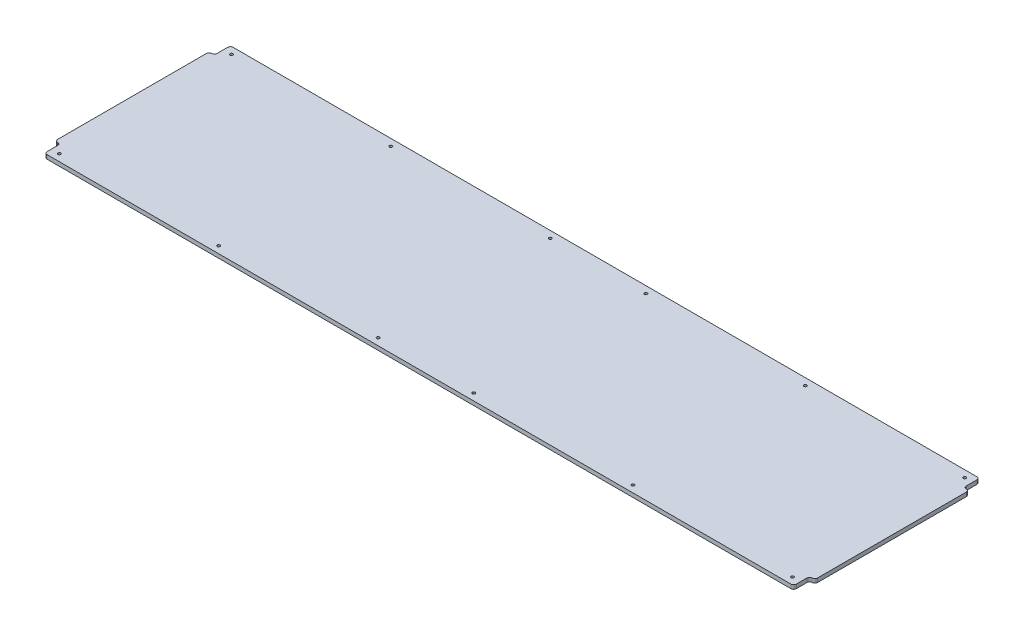
ISO-10303-21;
HEADER;
FILE_DESCRIPTION(('STEP AP214'),'2;1');
FILE_NAME('part.step','',(''),(''),'','','');
FILE_SCHEMA(('AUTOMOTIVE_DESIGN { 1 0 10303 214 1 1 1 1 }'));
ENDSEC;
DATA;
#1=APPLICATION_CONTEXT('core data for automotive mechanical design processes');
#2=APPLICATION_PROTOCOL_DEFINITION('international standard','automotive_design',2000,#1);
#3=PRODUCT_CONTEXT('',#1,'mechanical');
#4=PRODUCT('Part','Part','',(#3));
#5=PRODUCT_RELATED_PRODUCT_CATEGORY('part','',(#4));
#6=PRODUCT_DEFINITION_FORMATION('','',#4);
#7=PRODUCT_DEFINITION_CONTEXT('part definition',#1,'design');
#8=PRODUCT_DEFINITION('design','',#6,#7);
#9=PRODUCT_DEFINITION_SHAPE('','',#8);
#10=(LENGTH_UNIT() NAMED_UNIT(*) SI_UNIT(.MILLI.,.METRE.));
#11=(NAMED_UNIT(*) PLANE_ANGLE_UNIT() SI_UNIT($,.RADIAN.));
#12=(NAMED_UNIT(*) SI_UNIT($,.STERADIAN.) SOLID_ANGLE_UNIT());
#13=UNCERTAINTY_MEASURE_WITH_UNIT(LENGTH_MEASURE(1.E-05),#10,'distance_accuracy_value','');
#14=(GEOMETRIC_REPRESENTATION_CONTEXT(3) GLOBAL_UNCERTAINTY_ASSIGNED_CONTEXT((#13)) GLOBAL_UNIT_ASSIGNED_CONTEXT((#10,
#11,#12)) REPRESENTATION_CONTEXT('',''));
#15=CARTESIAN_POINT('',(0.,0.,0.));
#16=DIRECTION('',(0.,0.,1.));
#17=DIRECTION('',(1.,0.,0.));
#18=AXIS2_PLACEMENT_3D('',#15,#16,#17);
#19=CARTESIAN_POINT('',(895.35,9.525,222.25));
#20=DIRECTION('',(-1.,0.,0.));
#21=DIRECTION('',(0.,0.,1.));
#22=AXIS2_PLACEMENT_3D('',#19,#20,#21);
#23=PLANE('',#22);
#24=DIRECTION('',(0.,0.,-1.));
#25=VECTOR('',#24,1.);
#26=CARTESIAN_POINT('',(895.35,9.525,222.25));
#27=LINE('',#26,#25);
#28=CARTESIAN_POINT('',(895.35,9.525,215.9));
#29=VERTEX_POINT('',#28);
#30=CARTESIAN_POINT('',(895.35,9.525,190.5));
#31=VERTEX_POINT('',#30);
#32=EDGE_CURVE('E201',#29,#31,#27,.T.);
#33=ORIENTED_EDGE('',*,*,#32,.F.);
#34=DIRECTION('',(0.,-1.,0.));
#35=VECTOR('',#34,1.);
#36=CARTESIAN_POINT('',(895.35,9.525,215.9));
#37=LINE('',#36,#35);
#38=CARTESIAN_POINT('',(895.35,0.,215.9));
#39=VERTEX_POINT('',#38);
#40=EDGE_CURVE('E184',#29,#39,#37,.T.);
#41=ORIENTED_EDGE('',*,*,#40,.T.);
#42=DIRECTION('',(0.,0.,-1.));
#43=VECTOR('',#42,1.);
#44=CARTESIAN_POINT('',(895.35,0.,222.25));
#45=LINE('',#44,#43);
#46=CARTESIAN_POINT('',(895.35,0.,190.5));
#47=VERTEX_POINT('',#46);
#48=EDGE_CURVE('E198',#39,#47,#45,.T.);
#49=ORIENTED_EDGE('',*,*,#48,.T.);
#50=DIRECTION('',(0.,-1.,0.));
#51=VECTOR('',#50,1.);
#52=CARTESIAN_POINT('',(895.35,9.525,190.5));
#53=LINE('',#52,#51);
#54=EDGE_CURVE('E204',#47,#31,#53,.F.);
#55=ORIENTED_EDGE('',*,*,#54,.T.);
#56=EDGE_LOOP('',(#33,#41,#49,#55));
#57=FACE_BOUND('',#56,.T.);
#58=ADVANCED_FACE('F41',(#57),#23,.F.);
#59=CARTESIAN_POINT('',(908.05,9.525,-184.15));
#60=DIRECTION('',(-1.,0.,0.));
#61=DIRECTION('',(0.,0.,1.));
#62=AXIS2_PLACEMENT_3D('',#59,#60,#61);
#63=PLANE('',#62);
#64=DIRECTION('',(0.,0.,-1.));
#65=VECTOR('',#64,1.);
#66=CARTESIAN_POINT('',(908.05,9.525,-184.15));
#67=LINE('',#66,#65);
#68=CARTESIAN_POINT('',(908.05,9.525,177.8));
#69=VERTEX_POINT('',#68);
#70=CARTESIAN_POINT('',(908.05,9.525,-177.8));
#71=VERTEX_POINT('',#70);
#72=EDGE_CURVE('E697',#69,#71,#67,.T.);
#73=ORIENTED_EDGE('',*,*,#72,.F.);
#74=DIRECTION('',(0.,-1.,0.));
#75=VECTOR('',#74,1.);
#76=CARTESIAN_POINT('',(908.05,9.525,177.8));
#77=LINE('',#76,#75);
#78=CARTESIAN_POINT('',(908.05,0.,177.8));
#79=VERTEX_POINT('',#78);
#80=EDGE_CURVE('E301',#69,#79,#77,.T.);
#81=ORIENTED_EDGE('',*,*,#80,.T.);
#82=DIRECTION('',(0.,0.,-1.));
#83=VECTOR('',#82,1.);
#84=CARTESIAN_POINT('',(908.05,0.,-184.15));
#85=LINE('',#84,#83);
#86=CARTESIAN_POINT('',(908.05,0.,-177.8));
#87=VERTEX_POINT('',#86);
#88=EDGE_CURVE('E210',#79,#87,#85,.T.);
#89=ORIENTED_EDGE('',*,*,#88,.T.);
#90=DIRECTION('',(0.,-1.,0.));
#91=VECTOR('',#90,1.);
#92=CARTESIAN_POINT('',(908.05,9.525,-177.8));
#93=LINE('',#92,#91);
#94=EDGE_CURVE('E297',#87,#71,#93,.F.);
#95=ORIENTED_EDGE('',*,*,#94,.T.);
#96=EDGE_LOOP('',(#73,#81,#89,#95));
#97=FACE_BOUND('',#96,.T.);
#98=ADVANCED_FACE('F439',(#97),#63,.F.);
#99=CARTESIAN_POINT('',(895.35,9.525,-222.25));
#100=DIRECTION('',(-1.,0.,0.));
#101=DIRECTION('',(0.,0.,1.));
#102=AXIS2_PLACEMENT_3D('',#99,#100,#101);
#103=PLANE('',#102);
#104=DIRECTION('',(0.,0.,-1.));
#105=VECTOR('',#104,1.);
#106=CARTESIAN_POINT('',(895.35,9.525,-222.25));
#107=LINE('',#106,#105);
#108=CARTESIAN_POINT('',(895.35,9.525,-190.5));
#109=VERTEX_POINT('',#108);
#110=CARTESIAN_POINT('',(895.35,9.525,-215.9));
#111=VERTEX_POINT('',#110);
#112=EDGE_CURVE('E415',#109,#111,#107,.T.);
#113=ORIENTED_EDGE('',*,*,#112,.F.);
#114=DIRECTION('',(0.,-1.,0.));
#115=VECTOR('',#114,1.);
#116=CARTESIAN_POINT('',(895.35,0.,-190.5));
#117=LINE('',#116,#115);
#118=CARTESIAN_POINT('',(895.35,0.,-190.5));
#119=VERTEX_POINT('',#118);
#120=EDGE_CURVE('E307',#109,#119,#117,.T.);
#121=ORIENTED_EDGE('',*,*,#120,.T.);
#122=DIRECTION('',(0.,0.,-1.));
#123=VECTOR('',#122,1.);
#124=CARTESIAN_POINT('',(895.35,0.,-222.25));
#125=LINE('',#124,#123);
#126=CARTESIAN_POINT('',(895.35,0.,-215.9));
#127=VERTEX_POINT('',#126);
#128=EDGE_CURVE('E217',#119,#127,#125,.T.);
#129=ORIENTED_EDGE('',*,*,#128,.T.);
#130=DIRECTION('',(0.,-1.,0.));
#131=VECTOR('',#130,1.);
#132=CARTESIAN_POINT('',(895.35,9.525,-215.9));
#133=LINE('',#132,#131);
#134=EDGE_CURVE('E304',#127,#111,#133,.F.);
#135=ORIENTED_EDGE('',*,*,#134,.T.);
#136=EDGE_LOOP('',(#113,#121,#129,#135));
#137=FACE_BOUND('',#136,.T.);
#138=ADVANCED_FACE('F444',(#137),#103,.F.);
#139=CARTESIAN_POINT('',(-895.35,9.525,-222.25));
#140=DIRECTION('',(0.,0.,1.));
#141=DIRECTION('',(1.,0.,0.));
#142=AXIS2_PLACEMENT_3D('',#139,#140,#141);
#143=PLANE('',#142);
#144=DIRECTION('',(-1.,0.,0.));
#145=VECTOR('',#144,1.);
#146=CARTESIAN_POINT('',(-895.35,9.525,-222.25));
#147=LINE('',#146,#145);
#148=CARTESIAN_POINT('',(889.,9.525,-222.25));
#149=VERTEX_POINT('',#148);
#150=CARTESIAN_POINT('',(-889.,9.525,-222.25));
#151=VERTEX_POINT('',#150);
#152=EDGE_CURVE('E408',#149,#151,#147,.T.);
#153=ORIENTED_EDGE('',*,*,#152,.F.);
#154=DIRECTION('',(0.,-1.,0.));
#155=VECTOR('',#154,1.);
#156=CARTESIAN_POINT('',(889.,9.525,-222.25));
#157=LINE('',#156,#155);
#158=CARTESIAN_POINT('',(889.,0.,-222.25));
#159=VERTEX_POINT('',#158);
#160=EDGE_CURVE('E313',#149,#159,#157,.T.);
#161=ORIENTED_EDGE('',*,*,#160,.T.);
#162=DIRECTION('',(-1.,0.,0.));
#163=VECTOR('',#162,1.);
#164=CARTESIAN_POINT('',(-895.35,0.,-222.25));
#165=LINE('',#164,#163);
#166=CARTESIAN_POINT('',(-889.,0.,-222.25));
#167=VERTEX_POINT('',#166);
#168=EDGE_CURVE('E229',#159,#167,#165,.T.);
#169=ORIENTED_EDGE('',*,*,#168,.T.);
#170=DIRECTION('',(0.,-1.,0.));
#171=VECTOR('',#170,1.);
#172=CARTESIAN_POINT('',(-889.,9.525,-222.25));
#173=LINE('',#172,#171);
#174=EDGE_CURVE('E310',#167,#151,#173,.F.);
#175=ORIENTED_EDGE('',*,*,#174,.T.);
#176=EDGE_LOOP('',(#153,#161,#169,#175));
#177=FACE_BOUND('',#176,.T.);
#178=ADVANCED_FACE('F659',(#177),#143,.F.);
#179=CARTESIAN_POINT('',(-895.35,9.525,-222.25));
#180=DIRECTION('',(1.,0.,0.));
#181=DIRECTION('',(0.,0.,-1.));
#182=AXIS2_PLACEMENT_3D('',#179,#180,#181);
#183=PLANE('',#182);
#184=DIRECTION('',(0.,0.,1.));
#185=VECTOR('',#184,1.);
#186=CARTESIAN_POINT('',(-895.35,0.,-222.25));
#187=LINE('',#186,#185);
#188=CARTESIAN_POINT('',(-895.35,0.,-215.9));
#189=VERTEX_POINT('',#188);
#190=CARTESIAN_POINT('',(-895.35,0.,-190.5));
#191=VERTEX_POINT('',#190);
#192=EDGE_CURVE('E233',#189,#191,#187,.T.);
#193=ORIENTED_EDGE('',*,*,#192,.T.);
#194=DIRECTION('',(0.,-1.,0.));
#195=VECTOR('',#194,1.);
#196=CARTESIAN_POINT('',(-895.35,9.525,-190.5));
#197=LINE('',#196,#195);
#198=CARTESIAN_POINT('',(-895.35,9.525,-190.5));
#199=VERTEX_POINT('',#198);
#200=EDGE_CURVE('E328',#191,#199,#197,.F.);
#201=ORIENTED_EDGE('',*,*,#200,.T.);
#202=DIRECTION('',(0.,0.,1.));
#203=VECTOR('',#202,1.);
#204=CARTESIAN_POINT('',(-895.35,9.525,-222.25));
#205=LINE('',#204,#203);
#206=CARTESIAN_POINT('',(-895.35,9.525,-215.9));
#207=VERTEX_POINT('',#206);
#208=EDGE_CURVE('E401',#207,#199,#205,.T.);
#209=ORIENTED_EDGE('',*,*,#208,.F.);
#210=DIRECTION('',(0.,-1.,0.));
#211=VECTOR('',#210,1.);
#212=CARTESIAN_POINT('',(-895.35,9.525,-215.9));
#213=LINE('',#212,#211);
#214=EDGE_CURVE('E324',#207,#189,#213,.T.);
#215=ORIENTED_EDGE('',*,*,#214,.T.);
#216=EDGE_LOOP('',(#193,#201,#209,#215));
#217=FACE_BOUND('',#216,.T.);
#218=ADVANCED_FACE('F400',(#217),#183,.F.);
#219=CARTESIAN_POINT('',(-908.05,9.525,-184.15));
#220=DIRECTION('',(1.,0.,0.));
#221=DIRECTION('',(0.,0.,-1.));
#222=AXIS2_PLACEMENT_3D('',#219,#220,#221);
#223=PLANE('',#222);
#224=DIRECTION('',(0.,0.,1.));
#225=VECTOR('',#224,1.);
#226=CARTESIAN_POINT('',(-908.05,9.525,-184.15));
#227=LINE('',#226,#225);
#228=CARTESIAN_POINT('',(-908.05,9.525,-177.8));
#229=VERTEX_POINT('',#228);
#230=CARTESIAN_POINT('',(-908.05,9.525,177.8));
#231=VERTEX_POINT('',#230);
#232=EDGE_CURVE('E389',#229,#231,#227,.T.);
#233=ORIENTED_EDGE('',*,*,#232,.F.);
#234=DIRECTION('',(0.,-1.,0.));
#235=VECTOR('',#234,1.);
#236=CARTESIAN_POINT('',(-908.05,9.525,-177.8));
#237=LINE('',#236,#235);
#238=CARTESIAN_POINT('',(-908.05,0.,-177.8));
#239=VERTEX_POINT('',#238);
#240=EDGE_CURVE('E320',#229,#239,#237,.T.);
#241=ORIENTED_EDGE('',*,*,#240,.T.);
#242=DIRECTION('',(0.,0.,1.));
#243=VECTOR('',#242,1.);
#244=CARTESIAN_POINT('',(-908.05,0.,-184.15));
#245=LINE('',#244,#243);
#246=CARTESIAN_POINT('',(-908.05,0.,177.8));
#247=VERTEX_POINT('',#246);
#248=EDGE_CURVE('E237',#239,#247,#245,.T.);
#249=ORIENTED_EDGE('',*,*,#248,.T.);
#250=DIRECTION('',(0.,-1.,0.));
#251=VECTOR('',#250,1.);
#252=CARTESIAN_POINT('',(-908.05,9.525,177.8));
#253=LINE('',#252,#251);
#254=EDGE_CURVE('E317',#247,#231,#253,.F.);
#255=ORIENTED_EDGE('',*,*,#254,.T.);
#256=EDGE_LOOP('',(#233,#241,#249,#255));
#257=FACE_BOUND('',#256,.T.);
#258=ADVANCED_FACE('F386',(#257),#223,.F.);
#259=CARTESIAN_POINT('',(-895.35,9.525,184.15));
#260=DIRECTION('',(1.,0.,0.));
#261=DIRECTION('',(0.,0.,-1.));
#262=AXIS2_PLACEMENT_3D('',#259,#260,#261);
#263=PLANE('',#262);
#264=DIRECTION('',(0.,0.,1.));
#265=VECTOR('',#264,1.);
#266=CARTESIAN_POINT('',(-895.35,0.,184.15));
#267=LINE('',#266,#265);
#268=CARTESIAN_POINT('',(-895.35,0.,190.5));
#269=VERTEX_POINT('',#268);
#270=CARTESIAN_POINT('',(-895.35,0.,215.9));
#271=VERTEX_POINT('',#270);
#272=EDGE_CURVE('E241',#269,#271,#267,.T.);
#273=ORIENTED_EDGE('',*,*,#272,.T.);
#274=DIRECTION('',(0.,-1.,0.));
#275=VECTOR('',#274,1.);
#276=CARTESIAN_POINT('',(-895.35,9.525,215.9));
#277=LINE('',#276,#275);
#278=CARTESIAN_POINT('',(-895.35,9.525,215.9));
#279=VERTEX_POINT('',#278);
#280=EDGE_CURVE('E59',#271,#279,#277,.F.);
#281=ORIENTED_EDGE('',*,*,#280,.T.);
#282=DIRECTION('',(0.,0.,1.));
#283=VECTOR('',#282,1.);
#284=CARTESIAN_POINT('',(-895.35,9.525,184.15));
#285=LINE('',#284,#283);
#286=CARTESIAN_POINT('',(-895.35,9.525,190.5));
#287=VERTEX_POINT('',#286);
#288=EDGE_CURVE('E413',#287,#279,#285,.T.);
#289=ORIENTED_EDGE('',*,*,#288,.F.);
#290=DIRECTION('',(0.,-1.,0.));
#291=VECTOR('',#290,1.);
#292=CARTESIAN_POINT('',(-895.35,0.,190.5));
#293=LINE('',#292,#291);
#294=EDGE_CURVE('E331',#287,#269,#293,.T.);
#295=ORIENTED_EDGE('',*,*,#294,.T.);
#296=EDGE_LOOP('',(#273,#281,#289,#295));
#297=FACE_BOUND('',#296,.T.);
#298=ADVANCED_FACE('F429',(#297),#263,.F.);
#299=CARTESIAN_POINT('',(-895.35,9.525,222.25));
#300=DIRECTION('',(0.,0.,-1.));
#301=DIRECTION('',(-1.,0.,0.));
#302=AXIS2_PLACEMENT_3D('',#299,#300,#301);
#303=PLANE('',#302);
#304=DIRECTION('',(1.,0.,0.));
#305=VECTOR('',#304,1.);
#306=CARTESIAN_POINT('',(-895.35,0.,222.25));
#307=LINE('',#306,#305);
#308=CARTESIAN_POINT('',(-889.,0.,222.25));
#309=VERTEX_POINT('',#308);
#310=CARTESIAN_POINT('',(889.,0.,222.25));
#311=VERTEX_POINT('',#310);
#312=EDGE_CURVE('E244',#309,#311,#307,.T.);
#313=ORIENTED_EDGE('',*,*,#312,.T.);
#314=DIRECTION('',(0.,-1.,0.));
#315=VECTOR('',#314,1.);
#316=CARTESIAN_POINT('',(889.,9.525,222.25));
#317=LINE('',#316,#315);
#318=CARTESIAN_POINT('',(889.,9.525,222.25));
#319=VERTEX_POINT('',#318);
#320=EDGE_CURVE('E185',#311,#319,#317,.F.);
#321=ORIENTED_EDGE('',*,*,#320,.T.);
#322=DIRECTION('',(1.,0.,0.));
#323=VECTOR('',#322,1.);
#324=CARTESIAN_POINT('',(-895.35,9.525,222.25));
#325=LINE('',#324,#323);
#326=CARTESIAN_POINT('',(-889.,9.525,222.25));
#327=VERTEX_POINT('',#326);
#328=EDGE_CURVE('E223',#327,#319,#325,.T.);
#329=ORIENTED_EDGE('',*,*,#328,.F.);
#330=DIRECTION('',(0.,-1.,0.));
#331=VECTOR('',#330,1.);
#332=CARTESIAN_POINT('',(-889.,9.525,222.25));
#333=LINE('',#332,#331);
#334=EDGE_CURVE('E191',#327,#309,#333,.T.);
#335=ORIENTED_EDGE('',*,*,#334,.T.);
#336=EDGE_LOOP('',(#313,#321,#329,#335));
#337=FACE_BOUND('',#336,.T.);
#338=ADVANCED_FACE('F426',(#337),#303,.F.);
#339=CARTESIAN_POINT('',(0.,9.525,0.));
#340=DIRECTION('',(0.,1.,0.));
#341=DIRECTION('',(0.,0.,1.));
#342=AXIS2_PLACEMENT_3D('',#339,#340,#341);
#343=PLANE('',#342);
#344=CARTESIAN_POINT('',(-876.3,9.525,205.74));
#345=DIRECTION('',(0.,1.,0.));
#346=DIRECTION('',(0.,0.,1.));
#347=AXIS2_PLACEMENT_3D('',#344,#345,#346);
#348=CIRCLE('',#347,3.373501);
#349=CARTESIAN_POINT('',(-876.3,9.525,209.113501));
#350=VERTEX_POINT('',#349);
#351=EDGE_CURVE('E360',#350,#350,#348,.T.);
#352=ORIENTED_EDGE('',*,*,#351,.F.);
#353=EDGE_LOOP('',(#352));
#354=FACE_BOUND('',#353,.T.);
#355=CARTESIAN_POINT('',(-495.3,9.525,205.74));
#356=DIRECTION('',(0.,1.,0.));
#357=DIRECTION('',(0.,0.,1.));
#358=AXIS2_PLACEMENT_3D('',#355,#356,#357);
#359=CIRCLE('',#358,3.373501);
#360=CARTESIAN_POINT('',(-495.3,9.525,209.113501));
#361=VERTEX_POINT('',#360);
#362=EDGE_CURVE('E798',#361,#361,#359,.T.);
#363=ORIENTED_EDGE('',*,*,#362,.F.);
#364=EDGE_LOOP('',(#363));
#365=FACE_BOUND('',#364,.T.);
#366=CARTESIAN_POINT('',(-876.3,9.525,-205.74));
#367=DIRECTION('',(0.,1.,0.));
#368=DIRECTION('',(0.,0.,1.));
#369=AXIS2_PLACEMENT_3D('',#366,#367,#368);
#370=CIRCLE('',#369,3.373501);
#371=CARTESIAN_POINT('',(-876.3,9.525,-202.366499));
#372=VERTEX_POINT('',#371);
#373=EDGE_CURVE('E790',#372,#372,#370,.T.);
#374=ORIENTED_EDGE('',*,*,#373,.F.);
#375=EDGE_LOOP('',(#374));
#376=FACE_BOUND('',#375,.T.);
#377=CARTESIAN_POINT('',(-495.3,9.525,-205.74));
#378=DIRECTION('',(0.,1.,0.));
#379=DIRECTION('',(0.,0.,1.));
#380=AXIS2_PLACEMENT_3D('',#377,#378,#379);
#381=CIRCLE('',#380,3.373501);
#382=CARTESIAN_POINT('',(-495.3,9.525,-202.366499));
#383=VERTEX_POINT('',#382);
#384=EDGE_CURVE('E782',#383,#383,#381,.T.);
#385=ORIENTED_EDGE('',*,*,#384,.F.);
#386=EDGE_LOOP('',(#385));
#387=FACE_BOUND('',#386,.T.);
#388=CARTESIAN_POINT('',(-114.3,9.525,-205.74));
#389=DIRECTION('',(0.,1.,0.));
#390=DIRECTION('',(0.,0.,1.));
#391=AXIS2_PLACEMENT_3D('',#388,#389,#390);
#392=CIRCLE('',#391,3.373501);
#393=CARTESIAN_POINT('',(-114.3,9.525,-202.366499));
#394=VERTEX_POINT('',#393);
#395=EDGE_CURVE('E774',#394,#394,#392,.T.);
#396=ORIENTED_EDGE('',*,*,#395,.F.);
#397=EDGE_LOOP('',(#396));
#398=FACE_BOUND('',#397,.T.);
#399=CARTESIAN_POINT('',(-114.3,9.525,205.74));
#400=DIRECTION('',(0.,1.,0.));
#401=DIRECTION('',(0.,0.,1.));
#402=AXIS2_PLACEMENT_3D('',#399,#400,#401);
#403=CIRCLE('',#402,3.373501);
#404=CARTESIAN_POINT('',(-114.3,9.525,209.113501));
#405=VERTEX_POINT('',#404);
#406=EDGE_CURVE('E766',#405,#405,#403,.T.);
#407=ORIENTED_EDGE('',*,*,#406,.F.);
#408=EDGE_LOOP('',(#407));
#409=FACE_BOUND('',#408,.T.);
#410=CARTESIAN_POINT('',(114.299999999999,9.525,205.74));
#411=DIRECTION('',(0.,1.,0.));
#412=DIRECTION('',(0.,0.,1.));
#413=AXIS2_PLACEMENT_3D('',#410,#411,#412);
#414=CIRCLE('',#413,3.373501);
#415=CARTESIAN_POINT('',(114.299999999999,9.525,209.113501));
#416=VERTEX_POINT('',#415);
#417=EDGE_CURVE('E758',#416,#416,#414,.T.);
#418=ORIENTED_EDGE('',*,*,#417,.F.);
#419=EDGE_LOOP('',(#418));
#420=FACE_BOUND('',#419,.T.);
#421=CARTESIAN_POINT('',(114.3,9.525,-205.74));
#422=DIRECTION('',(0.,1.,0.));
#423=DIRECTION('',(0.,0.,1.));
#424=AXIS2_PLACEMENT_3D('',#421,#422,#423);
#425=CIRCLE('',#424,3.373501);
#426=CARTESIAN_POINT('',(114.3,9.525,-202.366499));
#427=VERTEX_POINT('',#426);
#428=EDGE_CURVE('E750',#427,#427,#425,.T.);
#429=ORIENTED_EDGE('',*,*,#428,.F.);
#430=EDGE_LOOP('',(#429));
#431=FACE_BOUND('',#430,.T.);
#432=CARTESIAN_POINT('',(495.3,9.525,-205.739999999999));
#433=DIRECTION('',(0.,1.,0.));
#434=DIRECTION('',(0.,0.,1.));
#435=AXIS2_PLACEMENT_3D('',#432,#433,#434);
#436=CIRCLE('',#435,3.373501);
#437=CARTESIAN_POINT('',(495.3,9.525,-202.366498999999));
#438=VERTEX_POINT('',#437);
#439=EDGE_CURVE('E742',#438,#438,#436,.T.);
#440=ORIENTED_EDGE('',*,*,#439,.F.);
#441=EDGE_LOOP('',(#440));
#442=FACE_BOUND('',#441,.T.);
#443=CARTESIAN_POINT('',(876.3,9.525,-205.739999999999));
#444=DIRECTION('',(0.,1.,0.));
#445=DIRECTION('',(0.,0.,1.));
#446=AXIS2_PLACEMENT_3D('',#443,#444,#445);
#447=CIRCLE('',#446,3.373501);
#448=CARTESIAN_POINT('',(876.3,9.525,-202.366498999999));
#449=VERTEX_POINT('',#448);
#450=EDGE_CURVE('E734',#449,#449,#447,.T.);
#451=ORIENTED_EDGE('',*,*,#450,.F.);
#452=EDGE_LOOP('',(#451));
#453=FACE_BOUND('',#452,.T.);
#454=CARTESIAN_POINT('',(495.299999999999,9.525,205.74));
#455=DIRECTION('',(0.,1.,0.));
#456=DIRECTION('',(0.,0.,1.));
#457=AXIS2_PLACEMENT_3D('',#454,#455,#456);
#458=CIRCLE('',#457,3.373501);
#459=CARTESIAN_POINT('',(495.299999999999,9.525,209.113501));
#460=VERTEX_POINT('',#459);
#461=EDGE_CURVE('E726',#460,#460,#458,.T.);
#462=ORIENTED_EDGE('',*,*,#461,.F.);
#463=EDGE_LOOP('',(#462));
#464=FACE_BOUND('',#463,.T.);
#465=CARTESIAN_POINT('',(876.299999999999,9.525,205.740000000001));
#466=DIRECTION('',(0.,1.,0.));
#467=DIRECTION('',(0.,0.,1.));
#468=AXIS2_PLACEMENT_3D('',#465,#466,#467);
#469=CIRCLE('',#468,3.373501);
#470=CARTESIAN_POINT('',(876.299999999999,9.525,209.113501000001));
#471=VERTEX_POINT('',#470);
#472=EDGE_CURVE('E220',#471,#471,#469,.T.);
#473=ORIENTED_EDGE('',*,*,#472,.F.);
#474=EDGE_LOOP('',(#473));
#475=FACE_BOUND('',#474,.T.);
#476=ORIENTED_EDGE('',*,*,#328,.T.);
#477=CARTESIAN_POINT('',(889.,9.525,215.9));
#478=DIRECTION('',(0.,1.,0.));
#479=DIRECTION('',(0.,0.,1.));
#480=AXIS2_PLACEMENT_3D('',#477,#478,#479);
#481=CIRCLE('',#480,6.35);
#482=EDGE_CURVE('E294',#319,#29,#481,.T.);
#483=ORIENTED_EDGE('',*,*,#482,.T.);
#484=ORIENTED_EDGE('',*,*,#32,.T.);
#485=CARTESIAN_POINT('',(901.7,9.525,190.5));
#486=DIRECTION('',(0.,1.,0.));
#487=DIRECTION('',(0.,0.,1.));
#488=AXIS2_PLACEMENT_3D('',#485,#486,#487);
#489=CIRCLE('',#488,6.35);
#490=CARTESIAN_POINT('',(901.7,9.525,184.15));
#491=VERTEX_POINT('',#490);
#492=EDGE_CURVE('E339',#31,#491,#489,.F.);
#493=ORIENTED_EDGE('',*,*,#492,.T.);
#494=CARTESIAN_POINT('',(901.7,9.525,177.8));
#495=DIRECTION('',(0.,1.,0.));
#496=DIRECTION('',(0.,0.,1.));
#497=AXIS2_PLACEMENT_3D('',#494,#495,#496);
#498=CIRCLE('',#497,6.35);
#499=EDGE_CURVE('E291',#491,#69,#498,.T.);
#500=ORIENTED_EDGE('',*,*,#499,.T.);
#501=ORIENTED_EDGE('',*,*,#72,.T.);
#502=CARTESIAN_POINT('',(901.7,9.525,-177.8));
#503=DIRECTION('',(0.,1.,0.));
#504=DIRECTION('',(0.,0.,1.));
#505=AXIS2_PLACEMENT_3D('',#502,#503,#504);
#506=CIRCLE('',#505,6.35);
#507=CARTESIAN_POINT('',(901.7,9.525,-184.15));
#508=VERTEX_POINT('',#507);
#509=EDGE_CURVE('E288',#71,#508,#506,.T.);
#510=ORIENTED_EDGE('',*,*,#509,.T.);
#511=CARTESIAN_POINT('',(901.7,9.525,-190.5));
#512=DIRECTION('',(0.,1.,0.));
#513=DIRECTION('',(0.,0.,1.));
#514=AXIS2_PLACEMENT_3D('',#511,#512,#513);
#515=CIRCLE('',#514,6.35);
#516=EDGE_CURVE('E345',#508,#109,#515,.F.);
#517=ORIENTED_EDGE('',*,*,#516,.T.);
#518=ORIENTED_EDGE('',*,*,#112,.T.);
#519=CARTESIAN_POINT('',(889.,9.525,-215.9));
#520=DIRECTION('',(0.,1.,0.));
#521=DIRECTION('',(0.,0.,1.));
#522=AXIS2_PLACEMENT_3D('',#519,#520,#521);
#523=CIRCLE('',#522,6.35);
#524=EDGE_CURVE('E285',#111,#149,#523,.T.);
#525=ORIENTED_EDGE('',*,*,#524,.T.);
#526=ORIENTED_EDGE('',*,*,#152,.T.);
#527=CARTESIAN_POINT('',(-889.,9.525,-215.9));
#528=DIRECTION('',(0.,1.,0.));
#529=DIRECTION('',(0.,0.,1.));
#530=AXIS2_PLACEMENT_3D('',#527,#528,#529);
#531=CIRCLE('',#530,6.35);
#532=EDGE_CURVE('E279',#151,#207,#531,.T.);
#533=ORIENTED_EDGE('',*,*,#532,.T.);
#534=ORIENTED_EDGE('',*,*,#208,.T.);
#535=CARTESIAN_POINT('',(-901.7,9.525,-190.5));
#536=DIRECTION('',(0.,1.,0.));
#537=DIRECTION('',(0.,0.,1.));
#538=AXIS2_PLACEMENT_3D('',#535,#536,#537);
#539=CIRCLE('',#538,6.35);
#540=CARTESIAN_POINT('',(-901.7,9.525,-184.15));
#541=VERTEX_POINT('',#540);
#542=EDGE_CURVE('E351',#199,#541,#539,.F.);
#543=ORIENTED_EDGE('',*,*,#542,.T.);
#544=CARTESIAN_POINT('',(-901.7,9.525,-177.8));
#545=DIRECTION('',(0.,1.,0.));
#546=DIRECTION('',(0.,0.,1.));
#547=AXIS2_PLACEMENT_3D('',#544,#545,#546);
#548=CIRCLE('',#547,6.35);
#549=EDGE_CURVE('E282',#541,#229,#548,.T.);
#550=ORIENTED_EDGE('',*,*,#549,.T.);
#551=ORIENTED_EDGE('',*,*,#232,.T.);
#552=CARTESIAN_POINT('',(-901.7,9.525,177.8));
#553=DIRECTION('',(0.,1.,0.));
#554=DIRECTION('',(0.,0.,1.));
#555=AXIS2_PLACEMENT_3D('',#552,#553,#554);
#556=CIRCLE('',#555,6.35);
#557=CARTESIAN_POINT('',(-901.7,9.525,184.15));
#558=VERTEX_POINT('',#557);
#559=EDGE_CURVE('E273',#231,#558,#556,.T.);
#560=ORIENTED_EDGE('',*,*,#559,.T.);
#561=CARTESIAN_POINT('',(-901.7,9.525,190.5));
#562=DIRECTION('',(0.,1.,0.));
#563=DIRECTION('',(0.,0.,1.));
#564=AXIS2_PLACEMENT_3D('',#561,#562,#563);
#565=CIRCLE('',#564,6.35);
#566=EDGE_CURVE('E11',#558,#287,#565,.F.);
#567=ORIENTED_EDGE('',*,*,#566,.T.);
#568=ORIENTED_EDGE('',*,*,#288,.T.);
#569=CARTESIAN_POINT('',(-889.,9.525,215.9));
#570=DIRECTION('',(0.,1.,0.));
#571=DIRECTION('',(0.,0.,1.));
#572=AXIS2_PLACEMENT_3D('',#569,#570,#571);
#573=CIRCLE('',#572,6.35);
#574=EDGE_CURVE('E276',#279,#327,#573,.T.);
#575=ORIENTED_EDGE('',*,*,#574,.T.);
#576=EDGE_LOOP('',(#476,#483,#484,#493,#500,#501,#510,#517,#518,#525,#526,#533,#534,#543,#550,
#551,#560,#567,#568,#575));
#577=FACE_BOUND('',#576,.T.);
#578=ADVANCED_FACE('F404',(#354,#365,#376,#387,#398,#409,#420,#431,#442,#453,#464,#475,#577),
#343,.T.);
#579=CARTESIAN_POINT('',(0.,0.,0.));
#580=DIRECTION('',(0.,1.,0.));
#581=DIRECTION('',(0.,0.,1.));
#582=AXIS2_PLACEMENT_3D('',#579,#580,#581);
#583=PLANE('',#582);
#584=CARTESIAN_POINT('',(-876.3,0.,205.74));
#585=DIRECTION('',(0.,1.,0.));
#586=DIRECTION('',(0.,0.,1.));
#587=AXIS2_PLACEMENT_3D('',#584,#585,#586);
#588=CIRCLE('',#587,3.373501);
#589=CARTESIAN_POINT('',(-876.3,0.,209.113501));
#590=VERTEX_POINT('',#589);
#591=EDGE_CURVE('E802',#590,#590,#588,.T.);
#592=ORIENTED_EDGE('',*,*,#591,.T.);
#593=EDGE_LOOP('',(#592));
#594=FACE_BOUND('',#593,.T.);
#595=CARTESIAN_POINT('',(-495.3,0.,205.74));
#596=DIRECTION('',(0.,1.,0.));
#597=DIRECTION('',(0.,0.,1.));
#598=AXIS2_PLACEMENT_3D('',#595,#596,#597);
#599=CIRCLE('',#598,3.373501);
#600=CARTESIAN_POINT('',(-495.3,0.,209.113501));
#601=VERTEX_POINT('',#600);
#602=EDGE_CURVE('E794',#601,#601,#599,.T.);
#603=ORIENTED_EDGE('',*,*,#602,.T.);
#604=EDGE_LOOP('',(#603));
#605=FACE_BOUND('',#604,.T.);
#606=CARTESIAN_POINT('',(-876.3,0.,-205.74));
#607=DIRECTION('',(0.,1.,0.));
#608=DIRECTION('',(0.,0.,1.));
#609=AXIS2_PLACEMENT_3D('',#606,#607,#608);
#610=CIRCLE('',#609,3.373501);
#611=CARTESIAN_POINT('',(-876.3,0.,-202.366499));
#612=VERTEX_POINT('',#611);
#613=EDGE_CURVE('E786',#612,#612,#610,.T.);
#614=ORIENTED_EDGE('',*,*,#613,.T.);
#615=EDGE_LOOP('',(#614));
#616=FACE_BOUND('',#615,.T.);
#617=CARTESIAN_POINT('',(-495.3,0.,-205.74));
#618=DIRECTION('',(0.,1.,0.));
#619=DIRECTION('',(0.,0.,1.));
#620=AXIS2_PLACEMENT_3D('',#617,#618,#619);
#621=CIRCLE('',#620,3.373501);
#622=CARTESIAN_POINT('',(-495.3,0.,-202.366499));
#623=VERTEX_POINT('',#622);
#624=EDGE_CURVE('E778',#623,#623,#621,.T.);
#625=ORIENTED_EDGE('',*,*,#624,.T.);
#626=EDGE_LOOP('',(#625));
#627=FACE_BOUND('',#626,.T.);
#628=CARTESIAN_POINT('',(-114.3,0.,-205.74));
#629=DIRECTION('',(0.,1.,0.));
#630=DIRECTION('',(0.,0.,1.));
#631=AXIS2_PLACEMENT_3D('',#628,#629,#630);
#632=CIRCLE('',#631,3.373501);
#633=CARTESIAN_POINT('',(-114.3,0.,-202.366499));
#634=VERTEX_POINT('',#633);
#635=EDGE_CURVE('E770',#634,#634,#632,.T.);
#636=ORIENTED_EDGE('',*,*,#635,.T.);
#637=EDGE_LOOP('',(#636));
#638=FACE_BOUND('',#637,.T.);
#639=CARTESIAN_POINT('',(-114.3,0.,205.74));
#640=DIRECTION('',(0.,1.,0.));
#641=DIRECTION('',(0.,0.,1.));
#642=AXIS2_PLACEMENT_3D('',#639,#640,#641);
#643=CIRCLE('',#642,3.373501);
#644=CARTESIAN_POINT('',(-114.3,0.,209.113501));
#645=VERTEX_POINT('',#644);
#646=EDGE_CURVE('E762',#645,#645,#643,.T.);
#647=ORIENTED_EDGE('',*,*,#646,.T.);
#648=EDGE_LOOP('',(#647));
#649=FACE_BOUND('',#648,.T.);
#650=CARTESIAN_POINT('',(114.299999999999,0.,205.74));
#651=DIRECTION('',(0.,1.,0.));
#652=DIRECTION('',(0.,0.,1.));
#653=AXIS2_PLACEMENT_3D('',#650,#651,#652);
#654=CIRCLE('',#653,3.373501);
#655=CARTESIAN_POINT('',(114.299999999999,0.,209.113501));
#656=VERTEX_POINT('',#655);
#657=EDGE_CURVE('E754',#656,#656,#654,.T.);
#658=ORIENTED_EDGE('',*,*,#657,.T.);
#659=EDGE_LOOP('',(#658));
#660=FACE_BOUND('',#659,.T.);
#661=CARTESIAN_POINT('',(114.3,0.,-205.74));
#662=DIRECTION('',(0.,1.,0.));
#663=DIRECTION('',(0.,0.,1.));
#664=AXIS2_PLACEMENT_3D('',#661,#662,#663);
#665=CIRCLE('',#664,3.373501);
#666=CARTESIAN_POINT('',(114.3,0.,-202.366499));
#667=VERTEX_POINT('',#666);
#668=EDGE_CURVE('E746',#667,#667,#665,.T.);
#669=ORIENTED_EDGE('',*,*,#668,.T.);
#670=EDGE_LOOP('',(#669));
#671=FACE_BOUND('',#670,.T.);
#672=CARTESIAN_POINT('',(495.3,0.,-205.739999999999));
#673=DIRECTION('',(0.,1.,0.));
#674=DIRECTION('',(0.,0.,1.));
#675=AXIS2_PLACEMENT_3D('',#672,#673,#674);
#676=CIRCLE('',#675,3.373501);
#677=CARTESIAN_POINT('',(495.3,0.,-202.366498999999));
#678=VERTEX_POINT('',#677);
#679=EDGE_CURVE('E738',#678,#678,#676,.T.);
#680=ORIENTED_EDGE('',*,*,#679,.T.);
#681=EDGE_LOOP('',(#680));
#682=FACE_BOUND('',#681,.T.);
#683=CARTESIAN_POINT('',(876.3,0.,-205.739999999999));
#684=DIRECTION('',(0.,1.,0.));
#685=DIRECTION('',(0.,0.,1.));
#686=AXIS2_PLACEMENT_3D('',#683,#684,#685);
#687=CIRCLE('',#686,3.373501);
#688=CARTESIAN_POINT('',(876.3,0.,-202.366498999999));
#689=VERTEX_POINT('',#688);
#690=EDGE_CURVE('E730',#689,#689,#687,.T.);
#691=ORIENTED_EDGE('',*,*,#690,.T.);
#692=EDGE_LOOP('',(#691));
#693=FACE_BOUND('',#692,.T.);
#694=CARTESIAN_POINT('',(495.299999999999,0.,205.74));
#695=DIRECTION('',(0.,1.,0.));
#696=DIRECTION('',(0.,0.,1.));
#697=AXIS2_PLACEMENT_3D('',#694,#695,#696);
#698=CIRCLE('',#697,3.373501);
#699=CARTESIAN_POINT('',(495.299999999999,0.,209.113501));
#700=VERTEX_POINT('',#699);
#701=EDGE_CURVE('E722',#700,#700,#698,.T.);
#702=ORIENTED_EDGE('',*,*,#701,.T.);
#703=EDGE_LOOP('',(#702));
#704=FACE_BOUND('',#703,.T.);
#705=CARTESIAN_POINT('',(876.299999999999,0.,205.740000000001));
#706=DIRECTION('',(0.,1.,0.));
#707=DIRECTION('',(0.,0.,1.));
#708=AXIS2_PLACEMENT_3D('',#705,#706,#707);
#709=CIRCLE('',#708,3.373501);
#710=CARTESIAN_POINT('',(876.299999999999,0.,209.113501000001));
#711=VERTEX_POINT('',#710);
#712=EDGE_CURVE('E211',#711,#711,#709,.T.);
#713=ORIENTED_EDGE('',*,*,#712,.T.);
#714=EDGE_LOOP('',(#713));
#715=FACE_BOUND('',#714,.T.);
#716=ORIENTED_EDGE('',*,*,#48,.F.);
#717=CARTESIAN_POINT('',(889.,0.,215.9));
#718=DIRECTION('',(0.,1.,0.));
#719=DIRECTION('',(0.,0.,1.));
#720=AXIS2_PLACEMENT_3D('',#717,#718,#719);
#721=CIRCLE('',#720,6.35);
#722=EDGE_CURVE('E180',#39,#311,#721,.F.);
#723=ORIENTED_EDGE('',*,*,#722,.T.);
#724=ORIENTED_EDGE('',*,*,#312,.F.);
#725=CARTESIAN_POINT('',(-889.,0.,215.9));
#726=DIRECTION('',(0.,1.,0.));
#727=DIRECTION('',(0.,0.,1.));
#728=AXIS2_PLACEMENT_3D('',#725,#726,#727);
#729=CIRCLE('',#728,6.35);
#730=EDGE_CURVE('E251',#309,#271,#729,.F.);
#731=ORIENTED_EDGE('',*,*,#730,.T.);
#732=ORIENTED_EDGE('',*,*,#272,.F.);
#733=CARTESIAN_POINT('',(-901.7,0.,190.5));
#734=DIRECTION('',(0.,1.,0.));
#735=DIRECTION('',(0.,0.,1.));
#736=AXIS2_PLACEMENT_3D('',#733,#734,#735);
#737=CIRCLE('',#736,6.35);
#738=CARTESIAN_POINT('',(-901.7,0.,184.15));
#739=VERTEX_POINT('',#738);
#740=EDGE_CURVE('E51',#269,#739,#737,.T.);
#741=ORIENTED_EDGE('',*,*,#740,.T.);
#742=CARTESIAN_POINT('',(-901.7,0.,177.8));
#743=DIRECTION('',(0.,1.,0.));
#744=DIRECTION('',(0.,0.,1.));
#745=AXIS2_PLACEMENT_3D('',#742,#743,#744);
#746=CIRCLE('',#745,6.35);
#747=EDGE_CURVE('E203',#739,#247,#746,.F.);
#748=ORIENTED_EDGE('',*,*,#747,.T.);
#749=ORIENTED_EDGE('',*,*,#248,.F.);
#750=CARTESIAN_POINT('',(-901.7,0.,-177.8));
#751=DIRECTION('',(0.,1.,0.));
#752=DIRECTION('',(0.,0.,1.));
#753=AXIS2_PLACEMENT_3D('',#750,#751,#752);
#754=CIRCLE('',#753,6.35);
#755=CARTESIAN_POINT('',(-901.7,0.,-184.15));
#756=VERTEX_POINT('',#755);
#757=EDGE_CURVE('E257',#239,#756,#754,.F.);
#758=ORIENTED_EDGE('',*,*,#757,.T.);
#759=CARTESIAN_POINT('',(-901.7,0.,-190.5));
#760=DIRECTION('',(0.,1.,0.));
#761=DIRECTION('',(0.,0.,1.));
#762=AXIS2_PLACEMENT_3D('',#759,#760,#761);
#763=CIRCLE('',#762,6.35);
#764=EDGE_CURVE('E348',#756,#191,#763,.T.);
#765=ORIENTED_EDGE('',*,*,#764,.T.);
#766=ORIENTED_EDGE('',*,*,#192,.F.);
#767=CARTESIAN_POINT('',(-889.,0.,-215.9));
#768=DIRECTION('',(0.,1.,0.));
#769=DIRECTION('',(0.,0.,1.));
#770=AXIS2_PLACEMENT_3D('',#767,#768,#769);
#771=CIRCLE('',#770,6.35);
#772=EDGE_CURVE('E254',#189,#167,#771,.F.);
#773=ORIENTED_EDGE('',*,*,#772,.T.);
#774=ORIENTED_EDGE('',*,*,#168,.F.);
#775=CARTESIAN_POINT('',(889.,0.,-215.9));
#776=DIRECTION('',(0.,1.,0.));
#777=DIRECTION('',(0.,0.,1.));
#778=AXIS2_PLACEMENT_3D('',#775,#776,#777);
#779=CIRCLE('',#778,6.35);
#780=EDGE_CURVE('E260',#159,#127,#779,.F.);
#781=ORIENTED_EDGE('',*,*,#780,.T.);
#782=ORIENTED_EDGE('',*,*,#128,.F.);
#783=CARTESIAN_POINT('',(901.7,0.,-190.5));
#784=DIRECTION('',(0.,1.,0.));
#785=DIRECTION('',(0.,0.,1.));
#786=AXIS2_PLACEMENT_3D('',#783,#784,#785);
#787=CIRCLE('',#786,6.35);
#788=CARTESIAN_POINT('',(901.7,0.,-184.15));
#789=VERTEX_POINT('',#788);
#790=EDGE_CURVE('E342',#119,#789,#787,.T.);
#791=ORIENTED_EDGE('',*,*,#790,.T.);
#792=CARTESIAN_POINT('',(901.7,0.,-177.8));
#793=DIRECTION('',(0.,1.,0.));
#794=DIRECTION('',(0.,0.,1.));
#795=AXIS2_PLACEMENT_3D('',#792,#793,#794);
#796=CIRCLE('',#795,6.35);
#797=EDGE_CURVE('E263',#789,#87,#796,.F.);
#798=ORIENTED_EDGE('',*,*,#797,.T.);
#799=ORIENTED_EDGE('',*,*,#88,.F.);
#800=CARTESIAN_POINT('',(901.7,0.,177.8));
#801=DIRECTION('',(0.,1.,0.));
#802=DIRECTION('',(0.,0.,1.));
#803=AXIS2_PLACEMENT_3D('',#800,#801,#802);
#804=CIRCLE('',#803,6.35);
#805=CARTESIAN_POINT('',(901.7,0.,184.15));
#806=VERTEX_POINT('',#805);
#807=EDGE_CURVE('E192',#79,#806,#804,.F.);
#808=ORIENTED_EDGE('',*,*,#807,.T.);
#809=CARTESIAN_POINT('',(901.7,0.,190.5));
#810=DIRECTION('',(0.,1.,0.));
#811=DIRECTION('',(0.,0.,1.));
#812=AXIS2_PLACEMENT_3D('',#809,#810,#811);
#813=CIRCLE('',#812,6.35);
#814=EDGE_CURVE('E208',#806,#47,#813,.T.);
#815=ORIENTED_EDGE('',*,*,#814,.T.);
#816=EDGE_LOOP('',(#716,#723,#724,#731,#732,#741,#748,#749,#758,#765,#766,#773,#774,#781,#782,
#791,#798,#799,#808,#815));
#817=FACE_BOUND('',#816,.T.);
#818=ADVANCED_FACE('F206',(#594,#605,#616,#627,#638,#649,#660,#671,#682,#693,#704,#715,#817),
#583,.F.);
#819=CARTESIAN_POINT('',(876.299999999999,9.525,205.740000000001));
#820=DIRECTION('',(0.,1.,0.));
#821=DIRECTION('',(0.,0.,1.));
#822=AXIS2_PLACEMENT_3D('',#819,#820,#821);
#823=CYLINDRICAL_SURFACE('',#822,3.373501);
#824=ORIENTED_EDGE('',*,*,#712,.F.);
#825=EDGE_LOOP('',(#824));
#826=FACE_BOUND('',#825,.T.);
#827=ORIENTED_EDGE('',*,*,#472,.T.);
#828=EDGE_LOOP('',(#827));
#829=FACE_BOUND('',#828,.T.);
#830=ADVANCED_FACE('F614',(#826,#829),#823,.F.);
#831=CARTESIAN_POINT('',(495.299999999999,9.525,205.74));
#832=DIRECTION('',(0.,1.,0.));
#833=DIRECTION('',(0.,0.,1.));
#834=AXIS2_PLACEMENT_3D('',#831,#832,#833);
#835=CYLINDRICAL_SURFACE('',#834,3.373501);
#836=ORIENTED_EDGE('',*,*,#701,.F.);
#837=EDGE_LOOP('',(#836));
#838=FACE_BOUND('',#837,.T.);
#839=ORIENTED_EDGE('',*,*,#461,.T.);
#840=EDGE_LOOP('',(#839));
#841=FACE_BOUND('',#840,.T.);
#842=ADVANCED_FACE('F606',(#838,#841),#835,.F.);
#843=CARTESIAN_POINT('',(876.3,9.525,-205.739999999999));
#844=DIRECTION('',(0.,1.,0.));
#845=DIRECTION('',(0.,0.,1.));
#846=AXIS2_PLACEMENT_3D('',#843,#844,#845);
#847=CYLINDRICAL_SURFACE('',#846,3.373501);
#848=ORIENTED_EDGE('',*,*,#690,.F.);
#849=EDGE_LOOP('',(#848));
#850=FACE_BOUND('',#849,.T.);
#851=ORIENTED_EDGE('',*,*,#450,.T.);
#852=EDGE_LOOP('',(#851));
#853=FACE_BOUND('',#852,.T.);
#854=ADVANCED_FACE('F598',(#850,#853),#847,.F.);
#855=CARTESIAN_POINT('',(495.3,9.525,-205.739999999999));
#856=DIRECTION('',(0.,1.,0.));
#857=DIRECTION('',(0.,0.,1.));
#858=AXIS2_PLACEMENT_3D('',#855,#856,#857);
#859=CYLINDRICAL_SURFACE('',#858,3.373501);
#860=ORIENTED_EDGE('',*,*,#679,.F.);
#861=EDGE_LOOP('',(#860));
#862=FACE_BOUND('',#861,.T.);
#863=ORIENTED_EDGE('',*,*,#439,.T.);
#864=EDGE_LOOP('',(#863));
#865=FACE_BOUND('',#864,.T.);
#866=ADVANCED_FACE('F590',(#862,#865),#859,.F.);
#867=CARTESIAN_POINT('',(114.3,9.525,-205.74));
#868=DIRECTION('',(0.,1.,0.));
#869=DIRECTION('',(0.,0.,1.));
#870=AXIS2_PLACEMENT_3D('',#867,#868,#869);
#871=CYLINDRICAL_SURFACE('',#870,3.373501);
#872=ORIENTED_EDGE('',*,*,#668,.F.);
#873=EDGE_LOOP('',(#872));
#874=FACE_BOUND('',#873,.T.);
#875=ORIENTED_EDGE('',*,*,#428,.T.);
#876=EDGE_LOOP('',(#875));
#877=FACE_BOUND('',#876,.T.);
#878=ADVANCED_FACE('F582',(#874,#877),#871,.F.);
#879=CARTESIAN_POINT('',(114.299999999999,9.525,205.74));
#880=DIRECTION('',(0.,1.,0.));
#881=DIRECTION('',(0.,0.,1.));
#882=AXIS2_PLACEMENT_3D('',#879,#880,#881);
#883=CYLINDRICAL_SURFACE('',#882,3.373501);
#884=ORIENTED_EDGE('',*,*,#657,.F.);
#885=EDGE_LOOP('',(#884));
#886=FACE_BOUND('',#885,.T.);
#887=ORIENTED_EDGE('',*,*,#417,.T.);
#888=EDGE_LOOP('',(#887));
#889=FACE_BOUND('',#888,.T.);
#890=ADVANCED_FACE('F574',(#886,#889),#883,.F.);
#891=CARTESIAN_POINT('',(-114.3,9.525,205.74));
#892=DIRECTION('',(0.,1.,0.));
#893=DIRECTION('',(0.,0.,1.));
#894=AXIS2_PLACEMENT_3D('',#891,#892,#893);
#895=CYLINDRICAL_SURFACE('',#894,3.373501);
#896=ORIENTED_EDGE('',*,*,#646,.F.);
#897=EDGE_LOOP('',(#896));
#898=FACE_BOUND('',#897,.T.);
#899=ORIENTED_EDGE('',*,*,#406,.T.);
#900=EDGE_LOOP('',(#899));
#901=FACE_BOUND('',#900,.T.);
#902=ADVANCED_FACE('F566',(#898,#901),#895,.F.);
#903=CARTESIAN_POINT('',(-114.3,9.525,-205.74));
#904=DIRECTION('',(0.,1.,0.));
#905=DIRECTION('',(0.,0.,1.));
#906=AXIS2_PLACEMENT_3D('',#903,#904,#905);
#907=CYLINDRICAL_SURFACE('',#906,3.373501);
#908=ORIENTED_EDGE('',*,*,#635,.F.);
#909=EDGE_LOOP('',(#908));
#910=FACE_BOUND('',#909,.T.);
#911=ORIENTED_EDGE('',*,*,#395,.T.);
#912=EDGE_LOOP('',(#911));
#913=FACE_BOUND('',#912,.T.);
#914=ADVANCED_FACE('F558',(#910,#913),#907,.F.);
#915=CARTESIAN_POINT('',(-495.3,9.525,-205.74));
#916=DIRECTION('',(0.,1.,0.));
#917=DIRECTION('',(0.,0.,1.));
#918=AXIS2_PLACEMENT_3D('',#915,#916,#917);
#919=CYLINDRICAL_SURFACE('',#918,3.373501);
#920=ORIENTED_EDGE('',*,*,#624,.F.);
#921=EDGE_LOOP('',(#920));
#922=FACE_BOUND('',#921,.T.);
#923=ORIENTED_EDGE('',*,*,#384,.T.);
#924=EDGE_LOOP('',(#923));
#925=FACE_BOUND('',#924,.T.);
#926=ADVANCED_FACE('F550',(#922,#925),#919,.F.);
#927=CARTESIAN_POINT('',(-876.3,9.525,-205.74));
#928=DIRECTION('',(0.,1.,0.));
#929=DIRECTION('',(0.,0.,1.));
#930=AXIS2_PLACEMENT_3D('',#927,#928,#929);
#931=CYLINDRICAL_SURFACE('',#930,3.373501);
#932=ORIENTED_EDGE('',*,*,#613,.F.);
#933=EDGE_LOOP('',(#932));
#934=FACE_BOUND('',#933,.T.);
#935=ORIENTED_EDGE('',*,*,#373,.T.);
#936=EDGE_LOOP('',(#935));
#937=FACE_BOUND('',#936,.T.);
#938=ADVANCED_FACE('F542',(#934,#937),#931,.F.);
#939=CARTESIAN_POINT('',(-495.3,9.525,205.74));
#940=DIRECTION('',(0.,1.,0.));
#941=DIRECTION('',(0.,0.,1.));
#942=AXIS2_PLACEMENT_3D('',#939,#940,#941);
#943=CYLINDRICAL_SURFACE('',#942,3.373501);
#944=ORIENTED_EDGE('',*,*,#602,.F.);
#945=EDGE_LOOP('',(#944));
#946=FACE_BOUND('',#945,.T.);
#947=ORIENTED_EDGE('',*,*,#362,.T.);
#948=EDGE_LOOP('',(#947));
#949=FACE_BOUND('',#948,.T.);
#950=ADVANCED_FACE('F534',(#946,#949),#943,.F.);
#951=CARTESIAN_POINT('',(-876.3,9.525,205.74));
#952=DIRECTION('',(0.,1.,0.));
#953=DIRECTION('',(0.,0.,1.));
#954=AXIS2_PLACEMENT_3D('',#951,#952,#953);
#955=CYLINDRICAL_SURFACE('',#954,3.373501);
#956=ORIENTED_EDGE('',*,*,#591,.F.);
#957=EDGE_LOOP('',(#956));
#958=FACE_BOUND('',#957,.T.);
#959=ORIENTED_EDGE('',*,*,#351,.T.);
#960=EDGE_LOOP('',(#959));
#961=FACE_BOUND('',#960,.T.);
#962=ADVANCED_FACE('F452',(#958,#961),#955,.F.);
#963=CARTESIAN_POINT('',(889.,9.525,215.9));
#964=DIRECTION('',(0.,-1.,0.));
#965=DIRECTION('',(0.,0.,-1.));
#966=AXIS2_PLACEMENT_3D('',#963,#964,#965);
#967=CYLINDRICAL_SURFACE('',#966,6.35);
#968=ORIENTED_EDGE('',*,*,#482,.F.);
#969=ORIENTED_EDGE('',*,*,#320,.F.);
#970=ORIENTED_EDGE('',*,*,#722,.F.);
#971=ORIENTED_EDGE('',*,*,#40,.F.);
#972=EDGE_LOOP('',(#968,#969,#970,#971));
#973=FACE_BOUND('',#972,.T.);
#974=ADVANCED_FACE('F183',(#973),#967,.T.);
#975=CARTESIAN_POINT('',(901.7,9.525,177.8));
#976=DIRECTION('',(0.,-1.,0.));
#977=DIRECTION('',(0.,0.,-1.));
#978=AXIS2_PLACEMENT_3D('',#975,#976,#977);
#979=CYLINDRICAL_SURFACE('',#978,6.35);
#980=ORIENTED_EDGE('',*,*,#80,.F.);
#981=ORIENTED_EDGE('',*,*,#499,.F.);
#982=DIRECTION('',(0.,-1.,0.));
#983=VECTOR('',#982,1.);
#984=CARTESIAN_POINT('',(901.7,9.525,184.15));
#985=LINE('',#984,#983);
#986=EDGE_CURVE('E356',#806,#491,#985,.F.);
#987=ORIENTED_EDGE('',*,*,#986,.F.);
#988=ORIENTED_EDGE('',*,*,#807,.F.);
#989=EDGE_LOOP('',(#980,#981,#987,#988));
#990=FACE_BOUND('',#989,.T.);
#991=ADVANCED_FACE('F451',(#990),#979,.T.);
#992=CARTESIAN_POINT('',(901.7,9.525,190.5));
#993=DIRECTION('',(0.,1.,0.));
#994=DIRECTION('',(0.,0.,1.));
#995=AXIS2_PLACEMENT_3D('',#992,#993,#994);
#996=CYLINDRICAL_SURFACE('',#995,6.35);
#997=ORIENTED_EDGE('',*,*,#492,.F.);
#998=ORIENTED_EDGE('',*,*,#54,.F.);
#999=ORIENTED_EDGE('',*,*,#814,.F.);
#1000=ORIENTED_EDGE('',*,*,#986,.T.);
#1001=EDGE_LOOP('',(#997,#998,#999,#1000));
#1002=FACE_BOUND('',#1001,.T.);
#1003=ADVANCED_FACE('F453',(#1002),#996,.F.);
#1004=CARTESIAN_POINT('',(901.7,9.525,-190.5));
#1005=DIRECTION('',(0.,1.,0.));
#1006=DIRECTION('',(0.,0.,1.));
#1007=AXIS2_PLACEMENT_3D('',#1004,#1005,#1006);
#1008=CYLINDRICAL_SURFACE('',#1007,6.35);
#1009=ORIENTED_EDGE('',*,*,#120,.F.);
#1010=ORIENTED_EDGE('',*,*,#516,.F.);
#1011=DIRECTION('',(0.,-1.,0.));
#1012=VECTOR('',#1011,1.);
#1013=CARTESIAN_POINT('',(901.7,9.525,-184.15));
#1014=LINE('',#1013,#1012);
#1015=EDGE_CURVE('E361',#789,#508,#1014,.F.);
#1016=ORIENTED_EDGE('',*,*,#1015,.F.);
#1017=ORIENTED_EDGE('',*,*,#790,.F.);
#1018=EDGE_LOOP('',(#1009,#1010,#1016,#1017));
#1019=FACE_BOUND('',#1018,.T.);
#1020=ADVANCED_FACE('F456',(#1019),#1008,.F.);
#1021=CARTESIAN_POINT('',(901.7,9.525,-177.8));
#1022=DIRECTION('',(0.,-1.,0.));
#1023=DIRECTION('',(0.,0.,-1.));
#1024=AXIS2_PLACEMENT_3D('',#1021,#1022,#1023);
#1025=CYLINDRICAL_SURFACE('',#1024,6.35);
#1026=ORIENTED_EDGE('',*,*,#509,.F.);
#1027=ORIENTED_EDGE('',*,*,#94,.F.);
#1028=ORIENTED_EDGE('',*,*,#797,.F.);
#1029=ORIENTED_EDGE('',*,*,#1015,.T.);
#1030=EDGE_LOOP('',(#1026,#1027,#1028,#1029));
#1031=FACE_BOUND('',#1030,.T.);
#1032=ADVANCED_FACE('F461',(#1031),#1025,.T.);
#1033=CARTESIAN_POINT('',(889.,9.525,-215.9));
#1034=DIRECTION('',(0.,-1.,0.));
#1035=DIRECTION('',(0.,0.,-1.));
#1036=AXIS2_PLACEMENT_3D('',#1033,#1034,#1035);
#1037=CYLINDRICAL_SURFACE('',#1036,6.35);
#1038=ORIENTED_EDGE('',*,*,#524,.F.);
#1039=ORIENTED_EDGE('',*,*,#134,.F.);
#1040=ORIENTED_EDGE('',*,*,#780,.F.);
#1041=ORIENTED_EDGE('',*,*,#160,.F.);
#1042=EDGE_LOOP('',(#1038,#1039,#1040,#1041));
#1043=FACE_BOUND('',#1042,.T.);
#1044=ADVANCED_FACE('F464',(#1043),#1037,.T.);
#1045=CARTESIAN_POINT('',(-901.7,9.525,-190.5));
#1046=DIRECTION('',(0.,1.,0.));
#1047=DIRECTION('',(0.,0.,1.));
#1048=AXIS2_PLACEMENT_3D('',#1045,#1046,#1047);
#1049=CYLINDRICAL_SURFACE('',#1048,6.35);
#1050=DIRECTION('',(0.,-1.,0.));
#1051=VECTOR('',#1050,1.);
#1052=CARTESIAN_POINT('',(-901.7,0.,-184.15));
#1053=LINE('',#1052,#1051);
#1054=EDGE_CURVE('E364',#541,#756,#1053,.T.);
#1055=ORIENTED_EDGE('',*,*,#1054,.F.);
#1056=ORIENTED_EDGE('',*,*,#542,.F.);
#1057=ORIENTED_EDGE('',*,*,#200,.F.);
#1058=ORIENTED_EDGE('',*,*,#764,.F.);
#1059=EDGE_LOOP('',(#1055,#1056,#1057,#1058));
#1060=FACE_BOUND('',#1059,.T.);
#1061=ADVANCED_FACE('F395',(#1060),#1049,.F.);
#1062=CARTESIAN_POINT('',(-901.7,9.525,-177.8));
#1063=DIRECTION('',(0.,-1.,0.));
#1064=DIRECTION('',(0.,0.,-1.));
#1065=AXIS2_PLACEMENT_3D('',#1062,#1063,#1064);
#1066=CYLINDRICAL_SURFACE('',#1065,6.35);
#1067=ORIENTED_EDGE('',*,*,#549,.F.);
#1068=ORIENTED_EDGE('',*,*,#1054,.T.);
#1069=ORIENTED_EDGE('',*,*,#757,.F.);
#1070=ORIENTED_EDGE('',*,*,#240,.F.);
#1071=EDGE_LOOP('',(#1067,#1068,#1069,#1070));
#1072=FACE_BOUND('',#1071,.T.);
#1073=ADVANCED_FACE('F390',(#1072),#1066,.T.);
#1074=CARTESIAN_POINT('',(-889.,9.525,-215.9));
#1075=DIRECTION('',(0.,-1.,0.));
#1076=DIRECTION('',(0.,0.,-1.));
#1077=AXIS2_PLACEMENT_3D('',#1074,#1075,#1076);
#1078=CYLINDRICAL_SURFACE('',#1077,6.35);
#1079=ORIENTED_EDGE('',*,*,#532,.F.);
#1080=ORIENTED_EDGE('',*,*,#174,.F.);
#1081=ORIENTED_EDGE('',*,*,#772,.F.);
#1082=ORIENTED_EDGE('',*,*,#214,.F.);
#1083=EDGE_LOOP('',(#1079,#1080,#1081,#1082));
#1084=FACE_BOUND('',#1083,.T.);
#1085=ADVANCED_FACE('F474',(#1084),#1078,.T.);
#1086=CARTESIAN_POINT('',(-889.,9.525,215.9));
#1087=DIRECTION('',(0.,-1.,0.));
#1088=DIRECTION('',(0.,0.,-1.));
#1089=AXIS2_PLACEMENT_3D('',#1086,#1087,#1088);
#1090=CYLINDRICAL_SURFACE('',#1089,6.35);
#1091=ORIENTED_EDGE('',*,*,#574,.F.);
#1092=ORIENTED_EDGE('',*,*,#280,.F.);
#1093=ORIENTED_EDGE('',*,*,#730,.F.);
#1094=ORIENTED_EDGE('',*,*,#334,.F.);
#1095=EDGE_LOOP('',(#1091,#1092,#1093,#1094));
#1096=FACE_BOUND('',#1095,.T.);
#1097=ADVANCED_FACE('F428',(#1096),#1090,.T.);
#1098=CARTESIAN_POINT('',(-901.7,9.525,177.8));
#1099=DIRECTION('',(0.,-1.,0.));
#1100=DIRECTION('',(0.,0.,-1.));
#1101=AXIS2_PLACEMENT_3D('',#1098,#1099,#1100);
#1102=CYLINDRICAL_SURFACE('',#1101,6.35);
#1103=DIRECTION('',(0.,-1.,0.));
#1104=VECTOR('',#1103,1.);
#1105=CARTESIAN_POINT('',(-901.7,9.525,184.15));
#1106=LINE('',#1105,#1104);
#1107=EDGE_CURVE('E45',#558,#739,#1106,.T.);
#1108=ORIENTED_EDGE('',*,*,#1107,.F.);
#1109=ORIENTED_EDGE('',*,*,#559,.F.);
#1110=ORIENTED_EDGE('',*,*,#254,.F.);
#1111=ORIENTED_EDGE('',*,*,#747,.F.);
#1112=EDGE_LOOP('',(#1108,#1109,#1110,#1111));
#1113=FACE_BOUND('',#1112,.T.);
#1114=ADVANCED_FACE('F43',(#1113),#1102,.T.);
#1115=CARTESIAN_POINT('',(-901.7,9.525,190.5));
#1116=DIRECTION('',(0.,1.,0.));
#1117=DIRECTION('',(0.,0.,1.));
#1118=AXIS2_PLACEMENT_3D('',#1115,#1116,#1117);
#1119=CYLINDRICAL_SURFACE('',#1118,6.35);
#1120=ORIENTED_EDGE('',*,*,#566,.F.);
#1121=ORIENTED_EDGE('',*,*,#1107,.T.);
#1122=ORIENTED_EDGE('',*,*,#740,.F.);
#1123=ORIENTED_EDGE('',*,*,#294,.F.);
#1124=EDGE_LOOP('',(#1120,#1121,#1122,#1123));
#1125=FACE_BOUND('',#1124,.T.);
#1126=ADVANCED_FACE('F376',(#1125),#1119,.F.);
#1127=CLOSED_SHELL('',(#58,#98,#138,#178,#218,#258,#298,#338,#578,#818,#830,#842,#854,#866,#878,
#890,#902,#914,#926,#938,#950,#962,#974,#991,#1003,#1020,#1032,#1044,#1061,#1073,#1085,#1097,
#1114,#1126));
#1128=MANIFOLD_SOLID_BREP('B2',#1127);
#1129=ADVANCED_BREP_SHAPE_REPRESENTATION('',(#18,#1128),#14);
#1130=SHAPE_DEFINITION_REPRESENTATION(#9,#1129);
ENDSEC;
END-ISO-10303-21;
